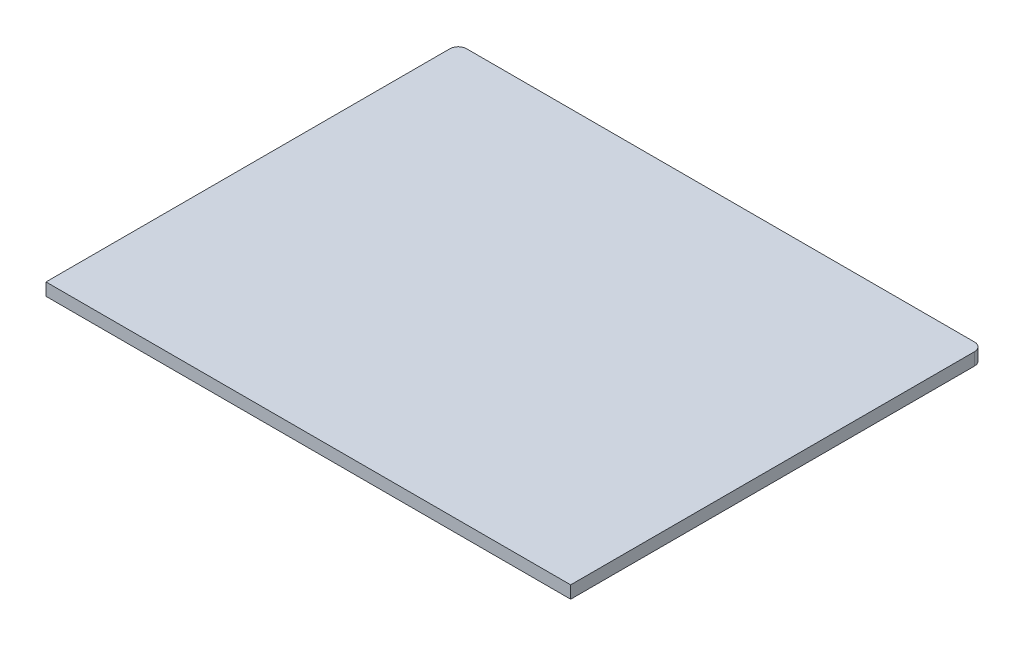
ISO-10303-21;
HEADER;
FILE_DESCRIPTION(('STEP AP214'),'2;1');
FILE_NAME('part.step','',(''),(''),'','','');
FILE_SCHEMA(('AUTOMOTIVE_DESIGN { 1 0 10303 214 1 1 1 1 }'));
ENDSEC;
DATA;
#1=APPLICATION_CONTEXT('core data for automotive mechanical design processes');
#2=APPLICATION_PROTOCOL_DEFINITION('international standard','automotive_design',2000,#1);
#3=PRODUCT_CONTEXT('',#1,'mechanical');
#4=PRODUCT('Part','Part','',(#3));
#5=PRODUCT_RELATED_PRODUCT_CATEGORY('part','',(#4));
#6=PRODUCT_DEFINITION_FORMATION('','',#4);
#7=PRODUCT_DEFINITION_CONTEXT('part definition',#1,'design');
#8=PRODUCT_DEFINITION('design','',#6,#7);
#9=PRODUCT_DEFINITION_SHAPE('','',#8);
#10=(LENGTH_UNIT() NAMED_UNIT(*) SI_UNIT(.MILLI.,.METRE.));
#11=(NAMED_UNIT(*) PLANE_ANGLE_UNIT() SI_UNIT($,.RADIAN.));
#12=(NAMED_UNIT(*) SI_UNIT($,.STERADIAN.) SOLID_ANGLE_UNIT());
#13=UNCERTAINTY_MEASURE_WITH_UNIT(LENGTH_MEASURE(1.E-05),#10,'distance_accuracy_value','');
#14=(GEOMETRIC_REPRESENTATION_CONTEXT(3) GLOBAL_UNCERTAINTY_ASSIGNED_CONTEXT((#13)) GLOBAL_UNIT_ASSIGNED_CONTEXT((#10,
#11,#12)) REPRESENTATION_CONTEXT('',''));
#15=CARTESIAN_POINT('',(0.,0.,0.));
#16=DIRECTION('',(0.,0.,1.));
#17=DIRECTION('',(1.,0.,0.));
#18=AXIS2_PLACEMENT_3D('',#15,#16,#17);
#19=CARTESIAN_POINT('',(-7.50495049504953,1.5,-17.9653465346535));
#20=DIRECTION('',(1.,0.,0.));
#21=DIRECTION('',(0.,0.,-1.));
#22=AXIS2_PLACEMENT_3D('',#19,#20,#21);
#23=PLANE('',#22);
#24=DIRECTION('',(0.,0.,1.));
#25=VECTOR('',#24,1.);
#26=CARTESIAN_POINT('',(-7.50495049504953,0.,-17.9653465346535));
#27=LINE('',#26,#25);
#28=CARTESIAN_POINT('',(-7.50495049504953,0.,-16.9653465346535));
#29=VERTEX_POINT('',#28);
#30=CARTESIAN_POINT('',(-7.50495049504951,0.,31.5346534653465));
#31=VERTEX_POINT('',#30);
#32=EDGE_CURVE('E112',#29,#31,#27,.T.);
#33=ORIENTED_EDGE('',*,*,#32,.T.);
#34=DIRECTION('',(0.,1.,0.));
#35=VECTOR('',#34,1.);
#36=CARTESIAN_POINT('',(-7.50495049504953,-8.5,31.5346534653465));
#37=LINE('',#36,#35);
#38=CARTESIAN_POINT('',(-7.50495049504953,1.5,31.5346534653465));
#39=VERTEX_POINT('',#38);
#40=EDGE_CURVE('E59',#31,#39,#37,.T.);
#41=ORIENTED_EDGE('',*,*,#40,.T.);
#42=DIRECTION('',(0.,0.,1.));
#43=VECTOR('',#42,1.);
#44=CARTESIAN_POINT('',(-7.50495049504953,1.5,-17.9653465346535));
#45=LINE('',#44,#43);
#46=CARTESIAN_POINT('',(-7.50495049504953,1.5,-16.9653465346535));
#47=VERTEX_POINT('',#46);
#48=EDGE_CURVE('E109',#47,#39,#45,.T.);
#49=ORIENTED_EDGE('',*,*,#48,.F.);
#50=DIRECTION('',(0.,-1.,0.));
#51=VECTOR('',#50,1.);
#52=CARTESIAN_POINT('',(-7.50495049504953,1.5,-16.9653465346535));
#53=LINE('',#52,#51);
#54=EDGE_CURVE('E150',#47,#29,#53,.T.);
#55=ORIENTED_EDGE('',*,*,#54,.T.);
#56=EDGE_LOOP('',(#33,#41,#49,#55));
#57=FACE_BOUND('',#56,.T.);
#58=ADVANCED_FACE('F43',(#57),#23,.F.);
#59=CARTESIAN_POINT('',(55.4950495049505,1.5,-17.9653465346535));
#60=DIRECTION('',(-1.,0.,0.));
#61=DIRECTION('',(0.,0.,1.));
#62=AXIS2_PLACEMENT_3D('',#59,#60,#61);
#63=PLANE('',#62);
#64=DIRECTION('',(0.,0.,-1.));
#65=VECTOR('',#64,1.);
#66=CARTESIAN_POINT('',(55.4950495049505,1.5,-17.9653465346535));
#67=LINE('',#66,#65);
#68=CARTESIAN_POINT('',(55.4950495049505,1.5,31.5346534653465));
#69=VERTEX_POINT('',#68);
#70=CARTESIAN_POINT('',(55.4950495049505,1.5,-16.9653465346535));
#71=VERTEX_POINT('',#70);
#72=EDGE_CURVE('E118',#69,#71,#67,.T.);
#73=ORIENTED_EDGE('',*,*,#72,.F.);
#74=DIRECTION('',(0.,-1.,0.));
#75=VECTOR('',#74,1.);
#76=CARTESIAN_POINT('',(55.4950495049505,1.5,31.5346534653465));
#77=LINE('',#76,#75);
#78=CARTESIAN_POINT('',(55.4950495049505,0.,31.5346534653465));
#79=VERTEX_POINT('',#78);
#80=EDGE_CURVE('E99',#69,#79,#77,.T.);
#81=ORIENTED_EDGE('',*,*,#80,.T.);
#82=DIRECTION('',(0.,0.,-1.));
#83=VECTOR('',#82,1.);
#84=CARTESIAN_POINT('',(55.4950495049505,0.,-17.9653465346535));
#85=LINE('',#84,#83);
#86=CARTESIAN_POINT('',(55.4950495049505,0.,-16.9653465346535));
#87=VERTEX_POINT('',#86);
#88=EDGE_CURVE('E125',#79,#87,#85,.T.);
#89=ORIENTED_EDGE('',*,*,#88,.T.);
#90=DIRECTION('',(0.,-1.,0.));
#91=VECTOR('',#90,1.);
#92=CARTESIAN_POINT('',(55.4950495049505,1.5,-16.9653465346535));
#93=LINE('',#92,#91);
#94=EDGE_CURVE('E143',#87,#71,#93,.F.);
#95=ORIENTED_EDGE('',*,*,#94,.T.);
#96=EDGE_LOOP('',(#73,#81,#89,#95));
#97=FACE_BOUND('',#96,.T.);
#98=ADVANCED_FACE('F174',(#97),#63,.F.);
#99=CARTESIAN_POINT('',(-7.50495049504953,1.5,-17.9653465346535));
#100=DIRECTION('',(0.,0.,1.));
#101=DIRECTION('',(1.,0.,0.));
#102=AXIS2_PLACEMENT_3D('',#99,#100,#101);
#103=PLANE('',#102);
#104=DIRECTION('',(-1.,0.,0.));
#105=VECTOR('',#104,1.);
#106=CARTESIAN_POINT('',(-7.50495049504953,0.,-17.9653465346535));
#107=LINE('',#106,#105);
#108=CARTESIAN_POINT('',(54.4950495049505,0.,-17.9653465346535));
#109=VERTEX_POINT('',#108);
#110=CARTESIAN_POINT('',(-6.50495049504953,0.,-17.9653465346535));
#111=VERTEX_POINT('',#110);
#112=EDGE_CURVE('E119',#109,#111,#107,.T.);
#113=ORIENTED_EDGE('',*,*,#112,.T.);
#114=DIRECTION('',(0.,-1.,0.));
#115=VECTOR('',#114,1.);
#116=CARTESIAN_POINT('',(-6.50495049504953,1.5,-17.9653465346535));
#117=LINE('',#116,#115);
#118=CARTESIAN_POINT('',(-6.50495049504953,1.5,-17.9653465346535));
#119=VERTEX_POINT('',#118);
#120=EDGE_CURVE('E66',#111,#119,#117,.F.);
#121=ORIENTED_EDGE('',*,*,#120,.T.);
#122=DIRECTION('',(-1.,0.,0.));
#123=VECTOR('',#122,1.);
#124=CARTESIAN_POINT('',(-7.50495049504953,1.5,-17.9653465346535));
#125=LINE('',#124,#123);
#126=CARTESIAN_POINT('',(54.4950495049505,1.5,-17.9653465346535));
#127=VERTEX_POINT('',#126);
#128=EDGE_CURVE('E123',#127,#119,#125,.T.);
#129=ORIENTED_EDGE('',*,*,#128,.F.);
#130=DIRECTION('',(0.,-1.,0.));
#131=VECTOR('',#130,1.);
#132=CARTESIAN_POINT('',(54.4950495049505,1.5,-17.9653465346535));
#133=LINE('',#132,#131);
#134=EDGE_CURVE('E131',#127,#109,#133,.T.);
#135=ORIENTED_EDGE('',*,*,#134,.T.);
#136=EDGE_LOOP('',(#113,#121,#129,#135));
#137=FACE_BOUND('',#136,.T.);
#138=ADVANCED_FACE('F163',(#137),#103,.F.);
#139=CARTESIAN_POINT('',(0.,1.5,0.));
#140=DIRECTION('',(0.,1.,0.));
#141=DIRECTION('',(0.,0.,1.));
#142=AXIS2_PLACEMENT_3D('',#139,#140,#141);
#143=PLANE('',#142);
#144=DIRECTION('',(-1.,0.,0.));
#145=VECTOR('',#144,1.);
#146=CARTESIAN_POINT('',(55.5527274185897,1.5,31.5346534653465));
#147=LINE('',#146,#145);
#148=EDGE_CURVE('E96',#69,#39,#147,.T.);
#149=ORIENTED_EDGE('',*,*,#148,.F.);
#150=ORIENTED_EDGE('',*,*,#72,.T.);
#151=CARTESIAN_POINT('',(54.4950495049505,1.5,-16.9653465346535));
#152=DIRECTION('',(0.,1.,0.));
#153=DIRECTION('',(0.,0.,1.));
#154=AXIS2_PLACEMENT_3D('',#151,#152,#153);
#155=CIRCLE('',#154,1.);
#156=EDGE_CURVE('E147',#71,#127,#155,.T.);
#157=ORIENTED_EDGE('',*,*,#156,.T.);
#158=ORIENTED_EDGE('',*,*,#128,.T.);
#159=CARTESIAN_POINT('',(-6.50495049504953,1.5,-16.9653465346535));
#160=DIRECTION('',(0.,1.,0.));
#161=DIRECTION('',(0.,0.,1.));
#162=AXIS2_PLACEMENT_3D('',#159,#160,#161);
#163=CIRCLE('',#162,1.);
#164=EDGE_CURVE('E52',#119,#47,#163,.T.);
#165=ORIENTED_EDGE('',*,*,#164,.T.);
#166=ORIENTED_EDGE('',*,*,#48,.T.);
#167=EDGE_LOOP('',(#149,#150,#157,#158,#165,#166));
#168=FACE_BOUND('',#167,.T.);
#169=ADVANCED_FACE('F115',(#168),#143,.T.);
#170=CARTESIAN_POINT('',(0.,0.,0.));
#171=DIRECTION('',(0.,1.,0.));
#172=DIRECTION('',(0.,0.,1.));
#173=AXIS2_PLACEMENT_3D('',#170,#171,#172);
#174=PLANE('',#173);
#175=ORIENTED_EDGE('',*,*,#88,.F.);
#176=DIRECTION('',(-1.,0.,0.));
#177=VECTOR('',#176,1.);
#178=CARTESIAN_POINT('',(0.,0.,31.5346534653465));
#179=LINE('',#178,#177);
#180=EDGE_CURVE('E11',#79,#31,#179,.T.);
#181=ORIENTED_EDGE('',*,*,#180,.T.);
#182=ORIENTED_EDGE('',*,*,#32,.F.);
#183=CARTESIAN_POINT('',(-6.50495049504953,0.,-16.9653465346535));
#184=DIRECTION('',(0.,1.,0.));
#185=DIRECTION('',(0.,0.,1.));
#186=AXIS2_PLACEMENT_3D('',#183,#184,#185);
#187=CIRCLE('',#186,1.);
#188=EDGE_CURVE('E153',#29,#111,#187,.F.);
#189=ORIENTED_EDGE('',*,*,#188,.T.);
#190=ORIENTED_EDGE('',*,*,#112,.F.);
#191=CARTESIAN_POINT('',(54.4950495049505,0.,-16.9653465346535));
#192=DIRECTION('',(0.,1.,0.));
#193=DIRECTION('',(0.,0.,1.));
#194=AXIS2_PLACEMENT_3D('',#191,#192,#193);
#195=CIRCLE('',#194,1.);
#196=EDGE_CURVE('E139',#109,#87,#195,.F.);
#197=ORIENTED_EDGE('',*,*,#196,.T.);
#198=EDGE_LOOP('',(#175,#181,#182,#189,#190,#197));
#199=FACE_BOUND('',#198,.T.);
#200=ADVANCED_FACE('F161',(#199),#174,.F.);
#201=CARTESIAN_POINT('',(54.4950495049505,1.5,-16.9653465346535));
#202=DIRECTION('',(0.,-1.,0.));
#203=DIRECTION('',(0.,0.,-1.));
#204=AXIS2_PLACEMENT_3D('',#201,#202,#203);
#205=CYLINDRICAL_SURFACE('',#204,1.);
#206=ORIENTED_EDGE('',*,*,#156,.F.);
#207=ORIENTED_EDGE('',*,*,#94,.F.);
#208=ORIENTED_EDGE('',*,*,#196,.F.);
#209=ORIENTED_EDGE('',*,*,#134,.F.);
#210=EDGE_LOOP('',(#206,#207,#208,#209));
#211=FACE_BOUND('',#210,.T.);
#212=ADVANCED_FACE('F166',(#211),#205,.T.);
#213=CARTESIAN_POINT('',(-6.50495049504953,1.5,-16.9653465346535));
#214=DIRECTION('',(0.,-1.,0.));
#215=DIRECTION('',(0.,0.,-1.));
#216=AXIS2_PLACEMENT_3D('',#213,#214,#215);
#217=CYLINDRICAL_SURFACE('',#216,1.);
#218=ORIENTED_EDGE('',*,*,#164,.F.);
#219=ORIENTED_EDGE('',*,*,#120,.F.);
#220=ORIENTED_EDGE('',*,*,#188,.F.);
#221=ORIENTED_EDGE('',*,*,#54,.F.);
#222=EDGE_LOOP('',(#218,#219,#220,#221));
#223=FACE_BOUND('',#222,.T.);
#224=ADVANCED_FACE('F45',(#223),#217,.T.);
#225=CARTESIAN_POINT('',(55.5527274185897,-8.5,31.5346534653465));
#226=DIRECTION('',(0.,0.,-1.));
#227=DIRECTION('',(-1.,0.,0.));
#228=AXIS2_PLACEMENT_3D('',#225,#226,#227);
#229=PLANE('',#228);
#230=ORIENTED_EDGE('',*,*,#148,.T.);
#231=ORIENTED_EDGE('',*,*,#40,.F.);
#232=ORIENTED_EDGE('',*,*,#180,.F.);
#233=ORIENTED_EDGE('',*,*,#80,.F.);
#234=EDGE_LOOP('',(#230,#231,#232,#233));
#235=FACE_BOUND('',#234,.T.);
#236=ADVANCED_FACE('F97',(#235),#229,.F.);
#237=CLOSED_SHELL('',(#58,#98,#138,#169,#200,#212,#224,#236));
#238=MANIFOLD_SOLID_BREP('B2',#237);
#239=ADVANCED_BREP_SHAPE_REPRESENTATION('',(#18,#238),#14);
#240=SHAPE_DEFINITION_REPRESENTATION(#9,#239);
ENDSEC;
END-ISO-10303-21;
